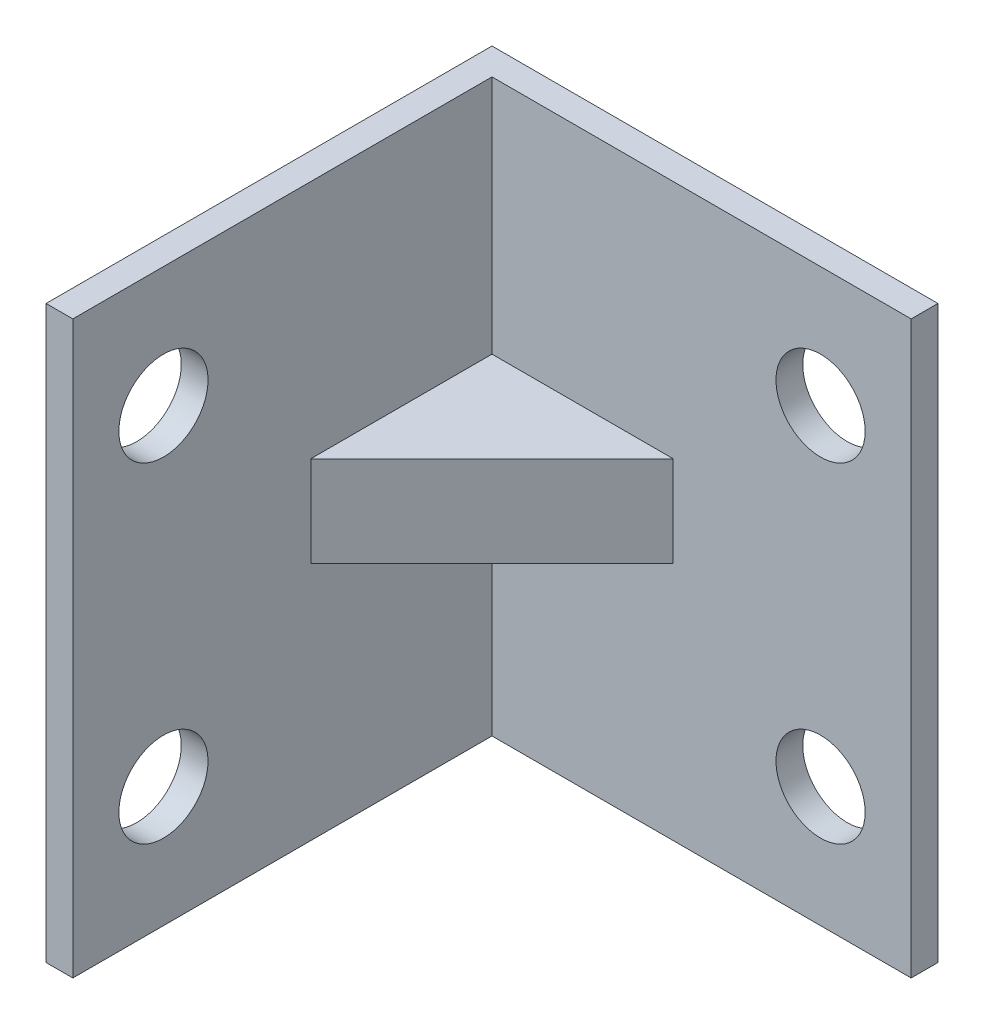
ISO-10303-21;
HEADER;
FILE_DESCRIPTION(('STEP AP214'),'2;1');
FILE_NAME('part.step','',(''),(''),'','','');
FILE_SCHEMA(('AUTOMOTIVE_DESIGN { 1 0 10303 214 1 1 1 1 }'));
ENDSEC;
DATA;
#1=APPLICATION_CONTEXT('core data for automotive mechanical design processes');
#2=APPLICATION_PROTOCOL_DEFINITION('international standard','automotive_design',2000,#1);
#3=PRODUCT_CONTEXT('',#1,'mechanical');
#4=PRODUCT('Part','Part','',(#3));
#5=PRODUCT_RELATED_PRODUCT_CATEGORY('part','',(#4));
#6=PRODUCT_DEFINITION_FORMATION('','',#4);
#7=PRODUCT_DEFINITION_CONTEXT('part definition',#1,'design');
#8=PRODUCT_DEFINITION('design','',#6,#7);
#9=PRODUCT_DEFINITION_SHAPE('','',#8);
#10=(LENGTH_UNIT() NAMED_UNIT(*) SI_UNIT(.MILLI.,.METRE.));
#11=(NAMED_UNIT(*) PLANE_ANGLE_UNIT() SI_UNIT($,.RADIAN.));
#12=(NAMED_UNIT(*) SI_UNIT($,.STERADIAN.) SOLID_ANGLE_UNIT());
#13=UNCERTAINTY_MEASURE_WITH_UNIT(LENGTH_MEASURE(1.E-05),#10,'distance_accuracy_value','');
#14=(GEOMETRIC_REPRESENTATION_CONTEXT(3) GLOBAL_UNCERTAINTY_ASSIGNED_CONTEXT((#13)) GLOBAL_UNIT_ASSIGNED_CONTEXT((#10,
#11,#12)) REPRESENTATION_CONTEXT('',''));
#15=CARTESIAN_POINT('',(0.,0.,0.));
#16=DIRECTION('',(0.,0.,1.));
#17=DIRECTION('',(1.,0.,0.));
#18=AXIS2_PLACEMENT_3D('',#15,#16,#17);
#19=CARTESIAN_POINT('',(0.,0.,1.5));
#20=DIRECTION('',(0.,0.,-1.));
#21=DIRECTION('',(-1.,0.,0.));
#22=AXIS2_PLACEMENT_3D('',#19,#20,#21);
#23=PLANE('',#22);
#24=CARTESIAN_POINT('',(7.42,9.25,1.5));
#25=DIRECTION('',(0.,0.,1.));
#26=DIRECTION('',(1.,0.,0.));
#27=AXIS2_PLACEMENT_3D('',#24,#25,#26);
#28=CIRCLE('',#27,2.5);
#29=CARTESIAN_POINT('',(9.92,9.25,1.5));
#30=VERTEX_POINT('',#29);
#31=EDGE_CURVE('E167',#30,#30,#28,.T.);
#32=ORIENTED_EDGE('',*,*,#31,.F.);
#33=EDGE_LOOP('',(#32));
#34=FACE_BOUND('',#33,.T.);
#35=CARTESIAN_POINT('',(7.42,-9.25,1.5));
#36=DIRECTION('',(0.,0.,1.));
#37=DIRECTION('',(1.,0.,0.));
#38=AXIS2_PLACEMENT_3D('',#35,#36,#37);
#39=CIRCLE('',#38,2.5);
#40=CARTESIAN_POINT('',(9.92,-9.25,1.5));
#41=VERTEX_POINT('',#40);
#42=EDGE_CURVE('E173',#41,#41,#39,.T.);
#43=ORIENTED_EDGE('',*,*,#42,.F.);
#44=EDGE_LOOP('',(#43));
#45=FACE_BOUND('',#44,.T.);
#46=DIRECTION('',(-1.,0.,0.));
#47=VECTOR('',#46,1.);
#48=CARTESIAN_POINT('',(-0.839999999999895,-2.54,1.5));
#49=LINE('',#48,#47);
#50=CARTESIAN_POINT('',(-0.839999999999899,-2.54,1.5));
#51=VERTEX_POINT('',#50);
#52=CARTESIAN_POINT('',(-11.,-2.54,1.5));
#53=VERTEX_POINT('',#52);
#54=EDGE_CURVE('E126',#51,#53,#49,.T.);
#55=ORIENTED_EDGE('',*,*,#54,.T.);
#56=DIRECTION('',(0.,-1.,0.));
#57=VECTOR('',#56,1.);
#58=CARTESIAN_POINT('',(-11.,0.,1.5));
#59=LINE('',#58,#57);
#60=CARTESIAN_POINT('',(-11.,-16.,1.5));
#61=VERTEX_POINT('',#60);
#62=EDGE_CURVE('E161',#53,#61,#59,.T.);
#63=ORIENTED_EDGE('',*,*,#62,.T.);
#64=DIRECTION('',(1.,0.,0.));
#65=VECTOR('',#64,1.);
#66=CARTESIAN_POINT('',(-12.5,-16.,1.5));
#67=LINE('',#66,#65);
#68=CARTESIAN_POINT('',(12.5,-16.,1.5));
#69=VERTEX_POINT('',#68);
#70=EDGE_CURVE('E181',#61,#69,#67,.T.);
#71=ORIENTED_EDGE('',*,*,#70,.T.);
#72=DIRECTION('',(0.,1.,0.));
#73=VECTOR('',#72,1.);
#74=CARTESIAN_POINT('',(12.5,16.,1.5));
#75=LINE('',#74,#73);
#76=CARTESIAN_POINT('',(12.5,16.,1.5));
#77=VERTEX_POINT('',#76);
#78=EDGE_CURVE('E184',#69,#77,#75,.T.);
#79=ORIENTED_EDGE('',*,*,#78,.T.);
#80=DIRECTION('',(-1.,0.,0.));
#81=VECTOR('',#80,1.);
#82=CARTESIAN_POINT('',(-12.5,16.,1.5));
#83=LINE('',#82,#81);
#84=CARTESIAN_POINT('',(-11.,16.,1.5));
#85=VERTEX_POINT('',#84);
#86=EDGE_CURVE('E179',#77,#85,#83,.T.);
#87=ORIENTED_EDGE('',*,*,#86,.T.);
#88=CARTESIAN_POINT('',(-11.,2.54,1.5));
#89=VERTEX_POINT('',#88);
#90=EDGE_CURVE('E164',#85,#89,#59,.T.);
#91=ORIENTED_EDGE('',*,*,#90,.T.);
#92=DIRECTION('',(-1.,0.,0.));
#93=VECTOR('',#92,1.);
#94=CARTESIAN_POINT('',(-0.839999999999895,2.54,1.5));
#95=LINE('',#94,#93);
#96=CARTESIAN_POINT('',(-0.839999999999895,2.54,1.5));
#97=VERTEX_POINT('',#96);
#98=EDGE_CURVE('E57',#97,#89,#95,.T.);
#99=ORIENTED_EDGE('',*,*,#98,.F.);
#100=DIRECTION('',(0.,1.,0.));
#101=VECTOR('',#100,1.);
#102=CARTESIAN_POINT('',(-0.839999999999895,-2.54,1.5));
#103=LINE('',#102,#101);
#104=EDGE_CURVE('E52',#51,#97,#103,.T.);
#105=ORIENTED_EDGE('',*,*,#104,.F.);
#106=EDGE_LOOP('',(#55,#63,#71,#79,#87,#91,#99,#105));
#107=FACE_BOUND('',#106,.T.);
#108=ADVANCED_FACE('F37',(#34,#45,#107),#23,.F.);
#109=CARTESIAN_POINT('',(-11.,0.,0.));
#110=DIRECTION('',(1.,0.,0.));
#111=DIRECTION('',(0.,1.,0.));
#112=AXIS2_PLACEMENT_3D('',#109,#110,#111);
#113=PLANE('',#112);
#114=CARTESIAN_POINT('',(-11.,-9.25,19.92));
#115=DIRECTION('',(-1.,0.,0.));
#116=DIRECTION('',(0.,-1.,0.));
#117=AXIS2_PLACEMENT_3D('',#114,#115,#116);
#118=CIRCLE('',#117,2.5);
#119=CARTESIAN_POINT('',(-11.,-11.75,19.92));
#120=VERTEX_POINT('',#119);
#121=EDGE_CURVE('E141',#120,#120,#118,.T.);
#122=ORIENTED_EDGE('',*,*,#121,.T.);
#123=EDGE_LOOP('',(#122));
#124=FACE_BOUND('',#123,.T.);
#125=CARTESIAN_POINT('',(-11.,9.25,19.92));
#126=DIRECTION('',(-1.,0.,0.));
#127=DIRECTION('',(0.,-1.,0.));
#128=AXIS2_PLACEMENT_3D('',#125,#126,#127);
#129=CIRCLE('',#128,2.5);
#130=CARTESIAN_POINT('',(-11.,6.75,19.92));
#131=VERTEX_POINT('',#130);
#132=EDGE_CURVE('E135',#131,#131,#129,.T.);
#133=ORIENTED_EDGE('',*,*,#132,.T.);
#134=EDGE_LOOP('',(#133));
#135=FACE_BOUND('',#134,.T.);
#136=ORIENTED_EDGE('',*,*,#62,.F.);
#137=DIRECTION('',(0.,0.,1.));
#138=VECTOR('',#137,1.);
#139=CARTESIAN_POINT('',(-11.,-2.54,1.5));
#140=LINE('',#139,#138);
#141=CARTESIAN_POINT('',(-11.,-2.54,11.66));
#142=VERTEX_POINT('',#141);
#143=EDGE_CURVE('E113',#53,#142,#140,.T.);
#144=ORIENTED_EDGE('',*,*,#143,.T.);
#145=DIRECTION('',(0.,1.,0.));
#146=VECTOR('',#145,1.);
#147=CARTESIAN_POINT('',(-11.,-2.54,11.66));
#148=LINE('',#147,#146);
#149=CARTESIAN_POINT('',(-11.,2.54,11.66));
#150=VERTEX_POINT('',#149);
#151=EDGE_CURVE('E106',#142,#150,#148,.T.);
#152=ORIENTED_EDGE('',*,*,#151,.T.);
#153=DIRECTION('',(0.,0.,1.));
#154=VECTOR('',#153,1.);
#155=CARTESIAN_POINT('',(-11.,2.54,1.5));
#156=LINE('',#155,#154);
#157=EDGE_CURVE('E111',#89,#150,#156,.T.);
#158=ORIENTED_EDGE('',*,*,#157,.F.);
#159=ORIENTED_EDGE('',*,*,#90,.F.);
#160=DIRECTION('',(0.,0.,-1.));
#161=VECTOR('',#160,1.);
#162=CARTESIAN_POINT('',(-11.,16.,0.));
#163=LINE('',#162,#161);
#164=CARTESIAN_POINT('',(-11.,16.,25.));
#165=VERTEX_POINT('',#164);
#166=EDGE_CURVE('E152',#165,#85,#163,.T.);
#167=ORIENTED_EDGE('',*,*,#166,.F.);
#168=DIRECTION('',(0.,1.,0.));
#169=VECTOR('',#168,1.);
#170=CARTESIAN_POINT('',(-11.,-16.,25.));
#171=LINE('',#170,#169);
#172=CARTESIAN_POINT('',(-11.,-16.,25.));
#173=VERTEX_POINT('',#172);
#174=EDGE_CURVE('E149',#173,#165,#171,.T.);
#175=ORIENTED_EDGE('',*,*,#174,.F.);
#176=DIRECTION('',(0.,0.,1.));
#177=VECTOR('',#176,1.);
#178=CARTESIAN_POINT('',(-11.,-16.,0.));
#179=LINE('',#178,#177);
#180=EDGE_CURVE('E147',#61,#173,#179,.T.);
#181=ORIENTED_EDGE('',*,*,#180,.F.);
#182=EDGE_LOOP('',(#136,#144,#152,#158,#159,#167,#175,#181));
#183=FACE_BOUND('',#182,.T.);
#184=ADVANCED_FACE('F109',(#124,#135,#183),#113,.T.);
#185=CARTESIAN_POINT('',(0.,0.,0.));
#186=DIRECTION('',(0.,0.,-1.));
#187=DIRECTION('',(-1.,0.,0.));
#188=AXIS2_PLACEMENT_3D('',#185,#186,#187);
#189=PLANE('',#188);
#190=DIRECTION('',(0.,1.,0.));
#191=VECTOR('',#190,1.);
#192=CARTESIAN_POINT('',(12.5,16.,0.));
#193=LINE('',#192,#191);
#194=CARTESIAN_POINT('',(12.5,-16.,0.));
#195=VERTEX_POINT('',#194);
#196=CARTESIAN_POINT('',(12.5,16.,0.));
#197=VERTEX_POINT('',#196);
#198=EDGE_CURVE('E182',#195,#197,#193,.T.);
#199=ORIENTED_EDGE('',*,*,#198,.F.);
#200=DIRECTION('',(1.,0.,0.));
#201=VECTOR('',#200,1.);
#202=CARTESIAN_POINT('',(-12.5,-16.,0.));
#203=LINE('',#202,#201);
#204=CARTESIAN_POINT('',(-12.5,-16.,0.));
#205=VERTEX_POINT('',#204);
#206=EDGE_CURVE('E190',#205,#195,#203,.T.);
#207=ORIENTED_EDGE('',*,*,#206,.F.);
#208=DIRECTION('',(0.,-1.,0.));
#209=VECTOR('',#208,1.);
#210=CARTESIAN_POINT('',(-12.5,16.,0.));
#211=LINE('',#210,#209);
#212=CARTESIAN_POINT('',(-12.5,16.,0.));
#213=VERTEX_POINT('',#212);
#214=EDGE_CURVE('E188',#213,#205,#211,.T.);
#215=ORIENTED_EDGE('',*,*,#214,.F.);
#216=DIRECTION('',(-1.,0.,0.));
#217=VECTOR('',#216,1.);
#218=CARTESIAN_POINT('',(-12.5,16.,0.));
#219=LINE('',#218,#217);
#220=EDGE_CURVE('E176',#197,#213,#219,.T.);
#221=ORIENTED_EDGE('',*,*,#220,.F.);
#222=EDGE_LOOP('',(#199,#207,#215,#221));
#223=FACE_BOUND('',#222,.T.);
#224=CARTESIAN_POINT('',(7.42,-9.25,0.));
#225=DIRECTION('',(0.,0.,1.));
#226=DIRECTION('',(1.,0.,0.));
#227=AXIS2_PLACEMENT_3D('',#224,#225,#226);
#228=CIRCLE('',#227,2.5);
#229=CARTESIAN_POINT('',(9.92,-9.25,0.));
#230=VERTEX_POINT('',#229);
#231=EDGE_CURVE('E170',#230,#230,#228,.T.);
#232=ORIENTED_EDGE('',*,*,#231,.T.);
#233=EDGE_LOOP('',(#232));
#234=FACE_BOUND('',#233,.T.);
#235=CARTESIAN_POINT('',(7.42,9.25,0.));
#236=DIRECTION('',(0.,0.,1.));
#237=DIRECTION('',(1.,0.,0.));
#238=AXIS2_PLACEMENT_3D('',#235,#236,#237);
#239=CIRCLE('',#238,2.5);
#240=CARTESIAN_POINT('',(9.92,9.25,0.));
#241=VERTEX_POINT('',#240);
#242=EDGE_CURVE('E166',#241,#241,#239,.T.);
#243=ORIENTED_EDGE('',*,*,#242,.T.);
#244=EDGE_LOOP('',(#243));
#245=FACE_BOUND('',#244,.T.);
#246=ADVANCED_FACE('F209',(#223,#234,#245),#189,.T.);
#247=CARTESIAN_POINT('',(-12.5,16.,1.5));
#248=DIRECTION('',(0.,-1.,0.));
#249=DIRECTION('',(1.,0.,0.));
#250=AXIS2_PLACEMENT_3D('',#247,#248,#249);
#251=PLANE('',#250);
#252=ORIENTED_EDGE('',*,*,#220,.T.);
#253=DIRECTION('',(0.,0.,-1.));
#254=VECTOR('',#253,1.);
#255=CARTESIAN_POINT('',(-12.5,16.,1.5));
#256=LINE('',#255,#254);
#257=CARTESIAN_POINT('',(-12.5,16.,25.));
#258=VERTEX_POINT('',#257);
#259=EDGE_CURVE('E11',#258,#213,#256,.T.);
#260=ORIENTED_EDGE('',*,*,#259,.F.);
#261=DIRECTION('',(-1.,0.,0.));
#262=VECTOR('',#261,1.);
#263=CARTESIAN_POINT('',(-11.,16.,25.));
#264=LINE('',#263,#262);
#265=EDGE_CURVE('E158',#165,#258,#264,.T.);
#266=ORIENTED_EDGE('',*,*,#265,.F.);
#267=ORIENTED_EDGE('',*,*,#166,.T.);
#268=ORIENTED_EDGE('',*,*,#86,.F.);
#269=DIRECTION('',(0.,0.,-1.));
#270=VECTOR('',#269,1.);
#271=CARTESIAN_POINT('',(12.5,16.,1.5));
#272=LINE('',#271,#270);
#273=EDGE_CURVE('E186',#77,#197,#272,.T.);
#274=ORIENTED_EDGE('',*,*,#273,.T.);
#275=EDGE_LOOP('',(#252,#260,#266,#267,#268,#274));
#276=FACE_BOUND('',#275,.T.);
#277=ADVANCED_FACE('F39',(#276),#251,.F.);
#278=CARTESIAN_POINT('',(-12.5,16.,1.5));
#279=DIRECTION('',(1.,0.,0.));
#280=DIRECTION('',(0.,1.,0.));
#281=AXIS2_PLACEMENT_3D('',#278,#279,#280);
#282=PLANE('',#281);
#283=ORIENTED_EDGE('',*,*,#214,.T.);
#284=DIRECTION('',(0.,0.,-1.));
#285=VECTOR('',#284,1.);
#286=CARTESIAN_POINT('',(-12.5,-16.,1.5));
#287=LINE('',#286,#285);
#288=CARTESIAN_POINT('',(-12.5,-16.,25.));
#289=VERTEX_POINT('',#288);
#290=EDGE_CURVE('E45',#289,#205,#287,.T.);
#291=ORIENTED_EDGE('',*,*,#290,.F.);
#292=DIRECTION('',(0.,1.,0.));
#293=VECTOR('',#292,1.);
#294=CARTESIAN_POINT('',(-12.5,-16.,25.));
#295=LINE('',#294,#293);
#296=EDGE_CURVE('E144',#289,#258,#295,.T.);
#297=ORIENTED_EDGE('',*,*,#296,.T.);
#298=ORIENTED_EDGE('',*,*,#259,.T.);
#299=EDGE_LOOP('',(#283,#291,#297,#298));
#300=FACE_BOUND('',#299,.T.);
#301=CARTESIAN_POINT('',(-12.5,9.25,19.92));
#302=DIRECTION('',(-1.,0.,0.));
#303=DIRECTION('',(0.,-1.,0.));
#304=AXIS2_PLACEMENT_3D('',#301,#302,#303);
#305=CIRCLE('',#304,2.5);
#306=CARTESIAN_POINT('',(-12.5,6.75,19.92));
#307=VERTEX_POINT('',#306);
#308=EDGE_CURVE('E133',#307,#307,#305,.T.);
#309=ORIENTED_EDGE('',*,*,#308,.F.);
#310=EDGE_LOOP('',(#309));
#311=FACE_BOUND('',#310,.T.);
#312=CARTESIAN_POINT('',(-12.5,-9.25,19.92));
#313=DIRECTION('',(-1.,0.,0.));
#314=DIRECTION('',(0.,-1.,0.));
#315=AXIS2_PLACEMENT_3D('',#312,#313,#314);
#316=CIRCLE('',#315,2.5);
#317=CARTESIAN_POINT('',(-12.5,-11.75,19.92));
#318=VERTEX_POINT('',#317);
#319=EDGE_CURVE('E138',#318,#318,#316,.T.);
#320=ORIENTED_EDGE('',*,*,#319,.F.);
#321=EDGE_LOOP('',(#320));
#322=FACE_BOUND('',#321,.T.);
#323=ADVANCED_FACE('F223',(#300,#311,#322),#282,.F.);
#324=CARTESIAN_POINT('',(-12.5,-16.,1.5));
#325=DIRECTION('',(0.,1.,0.));
#326=DIRECTION('',(0.,0.,1.));
#327=AXIS2_PLACEMENT_3D('',#324,#325,#326);
#328=PLANE('',#327);
#329=ORIENTED_EDGE('',*,*,#70,.F.);
#330=ORIENTED_EDGE('',*,*,#180,.T.);
#331=DIRECTION('',(-1.,0.,0.));
#332=VECTOR('',#331,1.);
#333=CARTESIAN_POINT('',(-11.,-16.,25.));
#334=LINE('',#333,#332);
#335=EDGE_CURVE('E155',#173,#289,#334,.T.);
#336=ORIENTED_EDGE('',*,*,#335,.T.);
#337=ORIENTED_EDGE('',*,*,#290,.T.);
#338=ORIENTED_EDGE('',*,*,#206,.T.);
#339=DIRECTION('',(0.,0.,-1.));
#340=VECTOR('',#339,1.);
#341=CARTESIAN_POINT('',(12.5,-16.,1.5));
#342=LINE('',#341,#340);
#343=EDGE_CURVE('E195',#69,#195,#342,.T.);
#344=ORIENTED_EDGE('',*,*,#343,.F.);
#345=EDGE_LOOP('',(#329,#330,#336,#337,#338,#344));
#346=FACE_BOUND('',#345,.T.);
#347=ADVANCED_FACE('F201',(#346),#328,.F.);
#348=CARTESIAN_POINT('',(12.5,16.,1.5));
#349=DIRECTION('',(-1.,0.,0.));
#350=DIRECTION('',(0.,-1.,0.));
#351=AXIS2_PLACEMENT_3D('',#348,#349,#350);
#352=PLANE('',#351);
#353=ORIENTED_EDGE('',*,*,#198,.T.);
#354=ORIENTED_EDGE('',*,*,#273,.F.);
#355=ORIENTED_EDGE('',*,*,#78,.F.);
#356=ORIENTED_EDGE('',*,*,#343,.T.);
#357=EDGE_LOOP('',(#353,#354,#355,#356));
#358=FACE_BOUND('',#357,.T.);
#359=ADVANCED_FACE('F214',(#358),#352,.F.);
#360=CARTESIAN_POINT('',(7.42,-9.25,1.5));
#361=DIRECTION('',(0.,0.,-1.));
#362=DIRECTION('',(-1.,0.,0.));
#363=AXIS2_PLACEMENT_3D('',#360,#361,#362);
#364=CYLINDRICAL_SURFACE('',#363,2.5);
#365=ORIENTED_EDGE('',*,*,#42,.T.);
#366=EDGE_LOOP('',(#365));
#367=FACE_BOUND('',#366,.T.);
#368=ORIENTED_EDGE('',*,*,#231,.F.);
#369=EDGE_LOOP('',(#368));
#370=FACE_BOUND('',#369,.T.);
#371=ADVANCED_FACE('F256',(#367,#370),#364,.F.);
#372=CARTESIAN_POINT('',(7.42,9.25,1.5));
#373=DIRECTION('',(0.,0.,-1.));
#374=DIRECTION('',(-1.,0.,0.));
#375=AXIS2_PLACEMENT_3D('',#372,#373,#374);
#376=CYLINDRICAL_SURFACE('',#375,2.5);
#377=ORIENTED_EDGE('',*,*,#31,.T.);
#378=EDGE_LOOP('',(#377));
#379=FACE_BOUND('',#378,.T.);
#380=ORIENTED_EDGE('',*,*,#242,.F.);
#381=EDGE_LOOP('',(#380));
#382=FACE_BOUND('',#381,.T.);
#383=ADVANCED_FACE('F241',(#379,#382),#376,.F.);
#384=CARTESIAN_POINT('',(-11.,-16.,25.));
#385=DIRECTION('',(0.,0.,1.));
#386=DIRECTION('',(1.,0.,0.));
#387=AXIS2_PLACEMENT_3D('',#384,#385,#386);
#388=PLANE('',#387);
#389=ORIENTED_EDGE('',*,*,#296,.F.);
#390=ORIENTED_EDGE('',*,*,#335,.F.);
#391=ORIENTED_EDGE('',*,*,#174,.T.);
#392=ORIENTED_EDGE('',*,*,#265,.T.);
#393=EDGE_LOOP('',(#389,#390,#391,#392));
#394=FACE_BOUND('',#393,.T.);
#395=ADVANCED_FACE('F222',(#394),#388,.T.);
#396=CARTESIAN_POINT('',(-11.,-9.25,19.92));
#397=DIRECTION('',(-1.,0.,0.));
#398=DIRECTION('',(0.,-1.,0.));
#399=AXIS2_PLACEMENT_3D('',#396,#397,#398);
#400=CYLINDRICAL_SURFACE('',#399,2.5);
#401=ORIENTED_EDGE('',*,*,#121,.F.);
#402=EDGE_LOOP('',(#401));
#403=FACE_BOUND('',#402,.T.);
#404=ORIENTED_EDGE('',*,*,#319,.T.);
#405=EDGE_LOOP('',(#404));
#406=FACE_BOUND('',#405,.T.);
#407=ADVANCED_FACE('F230',(#403,#406),#400,.F.);
#408=CARTESIAN_POINT('',(-11.,9.25,19.92));
#409=DIRECTION('',(-1.,0.,0.));
#410=DIRECTION('',(0.,-1.,0.));
#411=AXIS2_PLACEMENT_3D('',#408,#409,#410);
#412=CYLINDRICAL_SURFACE('',#411,2.5);
#413=ORIENTED_EDGE('',*,*,#132,.F.);
#414=EDGE_LOOP('',(#413));
#415=FACE_BOUND('',#414,.T.);
#416=ORIENTED_EDGE('',*,*,#308,.T.);
#417=EDGE_LOOP('',(#416));
#418=FACE_BOUND('',#417,.T.);
#419=ADVANCED_FACE('F232',(#415,#418),#412,.F.);
#420=CARTESIAN_POINT('',(-11.,-2.54,11.66));
#421=DIRECTION('',(0.707106781186544,0.,0.707106781186551));
#422=DIRECTION('',(0.707106781186551,0.,-0.707106781186544));
#423=AXIS2_PLACEMENT_3D('',#420,#421,#422);
#424=PLANE('',#423);
#425=ORIENTED_EDGE('',*,*,#104,.T.);
#426=DIRECTION('',(0.707106781186551,0.,-0.707106781186544));
#427=VECTOR('',#426,1.);
#428=CARTESIAN_POINT('',(-11.,2.54,11.66));
#429=LINE('',#428,#427);
#430=EDGE_CURVE('E123',#150,#97,#429,.T.);
#431=ORIENTED_EDGE('',*,*,#430,.F.);
#432=ORIENTED_EDGE('',*,*,#151,.F.);
#433=DIRECTION('',(0.707106781186551,0.,-0.707106781186544));
#434=VECTOR('',#433,1.);
#435=CARTESIAN_POINT('',(-11.,-2.54,11.66));
#436=LINE('',#435,#434);
#437=EDGE_CURVE('E118',#142,#51,#436,.T.);
#438=ORIENTED_EDGE('',*,*,#437,.T.);
#439=EDGE_LOOP('',(#425,#431,#432,#438));
#440=FACE_BOUND('',#439,.T.);
#441=ADVANCED_FACE('F125',(#440),#424,.T.);
#442=CARTESIAN_POINT('',(0.,-2.54,0.));
#443=DIRECTION('',(0.,1.,0.));
#444=DIRECTION('',(0.,0.,1.));
#445=AXIS2_PLACEMENT_3D('',#442,#443,#444);
#446=PLANE('',#445);
#447=ORIENTED_EDGE('',*,*,#54,.F.);
#448=ORIENTED_EDGE('',*,*,#437,.F.);
#449=ORIENTED_EDGE('',*,*,#143,.F.);
#450=EDGE_LOOP('',(#447,#448,#449));
#451=FACE_BOUND('',#450,.T.);
#452=ADVANCED_FACE('F322',(#451),#446,.F.);
#453=CARTESIAN_POINT('',(0.,2.54,0.));
#454=DIRECTION('',(0.,1.,0.));
#455=DIRECTION('',(0.,0.,1.));
#456=AXIS2_PLACEMENT_3D('',#453,#454,#455);
#457=PLANE('',#456);
#458=ORIENTED_EDGE('',*,*,#98,.T.);
#459=ORIENTED_EDGE('',*,*,#157,.T.);
#460=ORIENTED_EDGE('',*,*,#430,.T.);
#461=EDGE_LOOP('',(#458,#459,#460));
#462=FACE_BOUND('',#461,.T.);
#463=ADVANCED_FACE('F122',(#462),#457,.T.);
#464=CLOSED_SHELL('',(#108,#184,#246,#277,#323,#347,#359,#371,#383,#395,#407,#419,#441,#452,#463));
#465=MANIFOLD_SOLID_BREP('B2',#464);
#466=ADVANCED_BREP_SHAPE_REPRESENTATION('',(#18,#465),#14);
#467=SHAPE_DEFINITION_REPRESENTATION(#9,#466);
ENDSEC;
END-ISO-10303-21;
